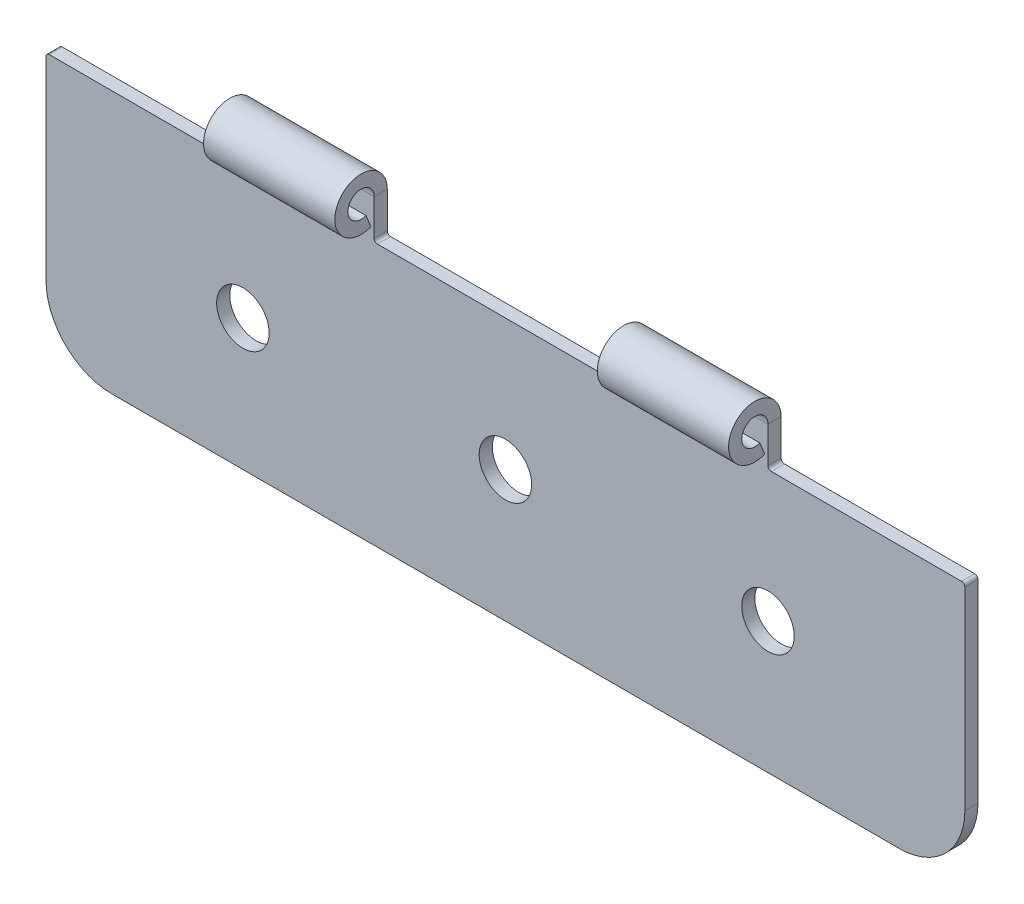
ISO-10303-21;
HEADER;
FILE_DESCRIPTION(('STEP AP214'),'2;1');
FILE_NAME('part.step','',(''),(''),'','','');
FILE_SCHEMA(('AUTOMOTIVE_DESIGN { 1 0 10303 214 1 1 1 1 }'));
ENDSEC;
DATA;
#1=APPLICATION_CONTEXT('core data for automotive mechanical design processes');
#2=APPLICATION_PROTOCOL_DEFINITION('international standard','automotive_design',2000,#1);
#3=PRODUCT_CONTEXT('',#1,'mechanical');
#4=PRODUCT('Part','Part','',(#3));
#5=PRODUCT_RELATED_PRODUCT_CATEGORY('part','',(#4));
#6=PRODUCT_DEFINITION_FORMATION('','',#4);
#7=PRODUCT_DEFINITION_CONTEXT('part definition',#1,'design');
#8=PRODUCT_DEFINITION('design','',#6,#7);
#9=PRODUCT_DEFINITION_SHAPE('','',#8);
#10=(LENGTH_UNIT() NAMED_UNIT(*) SI_UNIT(.MILLI.,.METRE.));
#11=(NAMED_UNIT(*) PLANE_ANGLE_UNIT() SI_UNIT($,.RADIAN.));
#12=(NAMED_UNIT(*) SI_UNIT($,.STERADIAN.) SOLID_ANGLE_UNIT());
#13=UNCERTAINTY_MEASURE_WITH_UNIT(LENGTH_MEASURE(1.E-05),#10,'distance_accuracy_value','');
#14=(GEOMETRIC_REPRESENTATION_CONTEXT(3) GLOBAL_UNCERTAINTY_ASSIGNED_CONTEXT((#13)) GLOBAL_UNIT_ASSIGNED_CONTEXT((#10,
#11,#12)) REPRESENTATION_CONTEXT('',''));
#15=CARTESIAN_POINT('',(0.,0.,0.));
#16=DIRECTION('',(0.,0.,1.));
#17=DIRECTION('',(1.,0.,0.));
#18=AXIS2_PLACEMENT_3D('',#15,#16,#17);
#19=CARTESIAN_POINT('',(45.,20.,-1.));
#20=DIRECTION('',(-1.,0.,0.));
#21=DIRECTION('',(0.,0.,1.));
#22=AXIS2_PLACEMENT_3D('',#19,#20,#21);
#23=PLANE('',#22);
#24=DIRECTION('',(0.,-1.,0.));
#25=VECTOR('',#24,1.);
#26=CARTESIAN_POINT('',(45.,20.,-1.));
#27=LINE('',#26,#25);
#28=CARTESIAN_POINT('',(45.,23.,-1.));
#29=VERTEX_POINT('',#28);
#30=CARTESIAN_POINT('',(45.,20.25,-1.));
#31=VERTEX_POINT('',#30);
#32=EDGE_CURVE('E213',#29,#31,#27,.T.);
#33=ORIENTED_EDGE('',*,*,#32,.T.);
#34=DIRECTION('',(0.,0.,1.));
#35=VECTOR('',#34,1.);
#36=CARTESIAN_POINT('',(45.,20.25,0.));
#37=LINE('',#36,#35);
#38=CARTESIAN_POINT('',(45.,20.25,0.));
#39=VERTEX_POINT('',#38);
#40=EDGE_CURVE('E422',#31,#39,#37,.T.);
#41=ORIENTED_EDGE('',*,*,#40,.T.);
#42=DIRECTION('',(0.,-1.,0.));
#43=VECTOR('',#42,1.);
#44=CARTESIAN_POINT('',(45.,20.,0.));
#45=LINE('',#44,#43);
#46=CARTESIAN_POINT('',(45.,23.,0.));
#47=VERTEX_POINT('',#46);
#48=EDGE_CURVE('E365',#47,#39,#45,.T.);
#49=ORIENTED_EDGE('',*,*,#48,.F.);
#50=DIRECTION('',(0.,0.,-1.));
#51=VECTOR('',#50,1.);
#52=CARTESIAN_POINT('',(45.,23.,0.));
#53=LINE('',#52,#51);
#54=EDGE_CURVE('E226',#47,#29,#53,.T.);
#55=ORIENTED_EDGE('',*,*,#54,.T.);
#56=EDGE_LOOP('',(#33,#41,#49,#55));
#57=FACE_BOUND('',#56,.T.);
#58=ADVANCED_FACE('F41',(#57),#23,.T.);
#59=CARTESIAN_POINT('',(15.,20.,-1.));
#60=DIRECTION('',(-1.,0.,0.));
#61=DIRECTION('',(0.,0.,1.));
#62=AXIS2_PLACEMENT_3D('',#59,#60,#61);
#63=PLANE('',#62);
#64=DIRECTION('',(0.,-1.,0.));
#65=VECTOR('',#64,1.);
#66=CARTESIAN_POINT('',(15.,20.,-1.));
#67=LINE('',#66,#65);
#68=CARTESIAN_POINT('',(15.,23.,-1.));
#69=VERTEX_POINT('',#68);
#70=CARTESIAN_POINT('',(15.,20.25,-1.));
#71=VERTEX_POINT('',#70);
#72=EDGE_CURVE('E339',#69,#71,#67,.T.);
#73=ORIENTED_EDGE('',*,*,#72,.T.);
#74=DIRECTION('',(0.,0.,1.));
#75=VECTOR('',#74,1.);
#76=CARTESIAN_POINT('',(15.,20.25,0.));
#77=LINE('',#76,#75);
#78=CARTESIAN_POINT('',(15.,20.25,0.));
#79=VERTEX_POINT('',#78);
#80=EDGE_CURVE('E436',#71,#79,#77,.T.);
#81=ORIENTED_EDGE('',*,*,#80,.T.);
#82=DIRECTION('',(0.,-1.,0.));
#83=VECTOR('',#82,1.);
#84=CARTESIAN_POINT('',(15.,20.,0.));
#85=LINE('',#84,#83);
#86=CARTESIAN_POINT('',(15.,23.,0.));
#87=VERTEX_POINT('',#86);
#88=EDGE_CURVE('E376',#87,#79,#85,.T.);
#89=ORIENTED_EDGE('',*,*,#88,.F.);
#90=DIRECTION('',(0.,0.,-1.));
#91=VECTOR('',#90,1.);
#92=CARTESIAN_POINT('',(15.,23.,0.));
#93=LINE('',#92,#91);
#94=EDGE_CURVE('E284',#87,#69,#93,.T.);
#95=ORIENTED_EDGE('',*,*,#94,.T.);
#96=EDGE_LOOP('',(#73,#81,#89,#95));
#97=FACE_BOUND('',#96,.T.);
#98=ADVANCED_FACE('F558',(#97),#63,.T.);
#99=CARTESIAN_POINT('',(70.,0.,-1.));
#100=DIRECTION('',(0.,-1.,0.));
#101=DIRECTION('',(1.,0.,0.));
#102=AXIS2_PLACEMENT_3D('',#99,#100,#101);
#103=PLANE('',#102);
#104=DIRECTION('',(1.,0.,0.));
#105=VECTOR('',#104,1.);
#106=CARTESIAN_POINT('',(70.,0.,0.));
#107=LINE('',#106,#105);
#108=CARTESIAN_POINT('',(5.,0.,0.));
#109=VERTEX_POINT('',#108);
#110=CARTESIAN_POINT('',(65.,0.,0.));
#111=VERTEX_POINT('',#110);
#112=EDGE_CURVE('E316',#109,#111,#107,.T.);
#113=ORIENTED_EDGE('',*,*,#112,.F.);
#114=DIRECTION('',(0.,0.,1.));
#115=VECTOR('',#114,1.);
#116=CARTESIAN_POINT('',(5.,0.,-1.));
#117=LINE('',#116,#115);
#118=CARTESIAN_POINT('',(5.,0.,-1.));
#119=VERTEX_POINT('',#118);
#120=EDGE_CURVE('E478',#109,#119,#117,.F.);
#121=ORIENTED_EDGE('',*,*,#120,.T.);
#122=DIRECTION('',(1.,0.,0.));
#123=VECTOR('',#122,1.);
#124=CARTESIAN_POINT('',(70.,0.,-1.));
#125=LINE('',#124,#123);
#126=CARTESIAN_POINT('',(65.,0.,-1.));
#127=VERTEX_POINT('',#126);
#128=EDGE_CURVE('E320',#119,#127,#125,.T.);
#129=ORIENTED_EDGE('',*,*,#128,.T.);
#130=DIRECTION('',(0.,0.,1.));
#131=VECTOR('',#130,1.);
#132=CARTESIAN_POINT('',(65.,0.,-1.));
#133=LINE('',#132,#131);
#134=EDGE_CURVE('E474',#127,#111,#133,.T.);
#135=ORIENTED_EDGE('',*,*,#134,.T.);
#136=EDGE_LOOP('',(#113,#121,#129,#135));
#137=FACE_BOUND('',#136,.T.);
#138=ADVANCED_FACE('F498',(#137),#103,.T.);
#139=CARTESIAN_POINT('',(0.,0.,-1.));
#140=DIRECTION('',(-1.,0.,0.));
#141=DIRECTION('',(0.,0.,1.));
#142=AXIS2_PLACEMENT_3D('',#139,#140,#141);
#143=PLANE('',#142);
#144=DIRECTION('',(0.,-1.,0.));
#145=VECTOR('',#144,1.);
#146=CARTESIAN_POINT('',(0.,0.,-1.));
#147=LINE('',#146,#145);
#148=CARTESIAN_POINT('',(0.,19.75,-1.));
#149=VERTEX_POINT('',#148);
#150=CARTESIAN_POINT('',(0.,5.,-1.));
#151=VERTEX_POINT('',#150);
#152=EDGE_CURVE('E347',#149,#151,#147,.T.);
#153=ORIENTED_EDGE('',*,*,#152,.T.);
#154=DIRECTION('',(0.,0.,1.));
#155=VECTOR('',#154,1.);
#156=CARTESIAN_POINT('',(0.,5.,-1.));
#157=LINE('',#156,#155);
#158=CARTESIAN_POINT('',(0.,5.,0.));
#159=VERTEX_POINT('',#158);
#160=EDGE_CURVE('E464',#151,#159,#157,.T.);
#161=ORIENTED_EDGE('',*,*,#160,.T.);
#162=DIRECTION('',(0.,-1.,0.));
#163=VECTOR('',#162,1.);
#164=CARTESIAN_POINT('',(0.,0.,0.));
#165=LINE('',#164,#163);
#166=CARTESIAN_POINT('',(0.,19.75,0.));
#167=VERTEX_POINT('',#166);
#168=EDGE_CURVE('E324',#167,#159,#165,.T.);
#169=ORIENTED_EDGE('',*,*,#168,.F.);
#170=DIRECTION('',(0.,0.,1.));
#171=VECTOR('',#170,1.);
#172=CARTESIAN_POINT('',(0.,19.75,-1.));
#173=LINE('',#172,#171);
#174=EDGE_CURVE('E399',#167,#149,#173,.F.);
#175=ORIENTED_EDGE('',*,*,#174,.T.);
#176=EDGE_LOOP('',(#153,#161,#169,#175));
#177=FACE_BOUND('',#176,.T.);
#178=ADVANCED_FACE('F490',(#177),#143,.T.);
#179=CARTESIAN_POINT('',(0.,20.,-1.));
#180=DIRECTION('',(0.,1.,0.));
#181=DIRECTION('',(0.,0.,1.));
#182=AXIS2_PLACEMENT_3D('',#179,#180,#181);
#183=PLANE('',#182);
#184=DIRECTION('',(-1.,0.,0.));
#185=VECTOR('',#184,1.);
#186=CARTESIAN_POINT('',(0.,20.,-1.));
#187=LINE('',#186,#185);
#188=CARTESIAN_POINT('',(14.75,20.,-1.));
#189=VERTEX_POINT('',#188);
#190=CARTESIAN_POINT('',(0.25,20.,-1.));
#191=VERTEX_POINT('',#190);
#192=EDGE_CURVE('E343',#189,#191,#187,.T.);
#193=ORIENTED_EDGE('',*,*,#192,.T.);
#194=DIRECTION('',(0.,0.,1.));
#195=VECTOR('',#194,1.);
#196=CARTESIAN_POINT('',(0.25,20.,-1.));
#197=LINE('',#196,#195);
#198=CARTESIAN_POINT('',(0.25,20.,0.));
#199=VERTEX_POINT('',#198);
#200=EDGE_CURVE('E389',#191,#199,#197,.T.);
#201=ORIENTED_EDGE('',*,*,#200,.T.);
#202=DIRECTION('',(-1.,0.,0.));
#203=VECTOR('',#202,1.);
#204=CARTESIAN_POINT('',(0.,20.,0.));
#205=LINE('',#204,#203);
#206=CARTESIAN_POINT('',(14.75,20.,0.));
#207=VERTEX_POINT('',#206);
#208=EDGE_CURVE('E380',#207,#199,#205,.T.);
#209=ORIENTED_EDGE('',*,*,#208,.F.);
#210=DIRECTION('',(0.,0.,1.));
#211=VECTOR('',#210,1.);
#212=CARTESIAN_POINT('',(14.75,20.,-1.));
#213=LINE('',#212,#211);
#214=EDGE_CURVE('E351',#207,#189,#213,.F.);
#215=ORIENTED_EDGE('',*,*,#214,.T.);
#216=EDGE_LOOP('',(#193,#201,#209,#215));
#217=FACE_BOUND('',#216,.T.);
#218=ADVANCED_FACE('F566',(#217),#183,.T.);
#219=CARTESIAN_POINT('',(25.,25.,-1.));
#220=DIRECTION('',(1.,0.,0.));
#221=DIRECTION('',(0.,0.,-1.));
#222=AXIS2_PLACEMENT_3D('',#219,#220,#221);
#223=PLANE('',#222);
#224=DIRECTION('',(0.,1.,0.));
#225=VECTOR('',#224,1.);
#226=CARTESIAN_POINT('',(25.,25.,0.));
#227=LINE('',#226,#225);
#228=CARTESIAN_POINT('',(25.,20.25,0.));
#229=VERTEX_POINT('',#228);
#230=CARTESIAN_POINT('',(25.,23.,0.));
#231=VERTEX_POINT('',#230);
#232=EDGE_CURVE('E373',#229,#231,#227,.T.);
#233=ORIENTED_EDGE('',*,*,#232,.F.);
#234=DIRECTION('',(0.,0.,1.));
#235=VECTOR('',#234,1.);
#236=CARTESIAN_POINT('',(25.,20.25,-1.));
#237=LINE('',#236,#235);
#238=CARTESIAN_POINT('',(25.,20.25,-1.));
#239=VERTEX_POINT('',#238);
#240=EDGE_CURVE('E433',#229,#239,#237,.F.);
#241=ORIENTED_EDGE('',*,*,#240,.T.);
#242=DIRECTION('',(0.,1.,0.));
#243=VECTOR('',#242,1.);
#244=CARTESIAN_POINT('',(25.,25.,-1.));
#245=LINE('',#244,#243);
#246=CARTESIAN_POINT('',(25.,23.,-1.));
#247=VERTEX_POINT('',#246);
#248=EDGE_CURVE('E336',#239,#247,#245,.T.);
#249=ORIENTED_EDGE('',*,*,#248,.T.);
#250=DIRECTION('',(0.,0.,-1.));
#251=VECTOR('',#250,1.);
#252=CARTESIAN_POINT('',(25.,23.,0.));
#253=LINE('',#252,#251);
#254=EDGE_CURVE('E306',#231,#247,#253,.T.);
#255=ORIENTED_EDGE('',*,*,#254,.F.);
#256=EDGE_LOOP('',(#233,#241,#249,#255));
#257=FACE_BOUND('',#256,.T.);
#258=ADVANCED_FACE('F544',(#257),#223,.T.);
#259=CARTESIAN_POINT('',(25.,20.,-1.));
#260=DIRECTION('',(0.,1.,0.));
#261=DIRECTION('',(0.,0.,1.));
#262=AXIS2_PLACEMENT_3D('',#259,#260,#261);
#263=PLANE('',#262);
#264=DIRECTION('',(-1.,0.,0.));
#265=VECTOR('',#264,1.);
#266=CARTESIAN_POINT('',(25.,20.,0.));
#267=LINE('',#266,#265);
#268=CARTESIAN_POINT('',(44.75,20.,0.));
#269=VERTEX_POINT('',#268);
#270=CARTESIAN_POINT('',(25.25,20.,0.));
#271=VERTEX_POINT('',#270);
#272=EDGE_CURVE('E369',#269,#271,#267,.T.);
#273=ORIENTED_EDGE('',*,*,#272,.F.);
#274=DIRECTION('',(0.,0.,1.));
#275=VECTOR('',#274,1.);
#276=CARTESIAN_POINT('',(44.75,20.,-1.));
#277=LINE('',#276,#275);
#278=CARTESIAN_POINT('',(44.75,20.,-1.));
#279=VERTEX_POINT('',#278);
#280=EDGE_CURVE('E430',#269,#279,#277,.F.);
#281=ORIENTED_EDGE('',*,*,#280,.T.);
#282=DIRECTION('',(-1.,0.,0.));
#283=VECTOR('',#282,1.);
#284=CARTESIAN_POINT('',(25.,20.,-1.));
#285=LINE('',#284,#283);
#286=CARTESIAN_POINT('',(25.25,20.,-1.));
#287=VERTEX_POINT('',#286);
#288=EDGE_CURVE('E332',#279,#287,#285,.T.);
#289=ORIENTED_EDGE('',*,*,#288,.T.);
#290=DIRECTION('',(0.,0.,1.));
#291=VECTOR('',#290,1.);
#292=CARTESIAN_POINT('',(25.25,20.,0.));
#293=LINE('',#292,#291);
#294=EDGE_CURVE('E426',#287,#271,#293,.T.);
#295=ORIENTED_EDGE('',*,*,#294,.T.);
#296=EDGE_LOOP('',(#273,#281,#289,#295));
#297=FACE_BOUND('',#296,.T.);
#298=ADVANCED_FACE('F530',(#297),#263,.T.);
#299=CARTESIAN_POINT('',(55.,25.,-1.));
#300=DIRECTION('',(1.,0.,0.));
#301=DIRECTION('',(0.,0.,-1.));
#302=AXIS2_PLACEMENT_3D('',#299,#300,#301);
#303=PLANE('',#302);
#304=DIRECTION('',(0.,1.,0.));
#305=VECTOR('',#304,1.);
#306=CARTESIAN_POINT('',(55.,25.,0.));
#307=LINE('',#306,#305);
#308=CARTESIAN_POINT('',(55.,20.25,0.));
#309=VERTEX_POINT('',#308);
#310=CARTESIAN_POINT('',(55.,23.,0.));
#311=VERTEX_POINT('',#310);
#312=EDGE_CURVE('E362',#309,#311,#307,.T.);
#313=ORIENTED_EDGE('',*,*,#312,.F.);
#314=DIRECTION('',(0.,0.,1.));
#315=VECTOR('',#314,1.);
#316=CARTESIAN_POINT('',(55.,20.25,-1.));
#317=LINE('',#316,#315);
#318=CARTESIAN_POINT('',(55.,20.25,-1.));
#319=VERTEX_POINT('',#318);
#320=EDGE_CURVE('E209',#309,#319,#317,.F.);
#321=ORIENTED_EDGE('',*,*,#320,.T.);
#322=DIRECTION('',(0.,1.,0.));
#323=VECTOR('',#322,1.);
#324=CARTESIAN_POINT('',(55.,25.,-1.));
#325=LINE('',#324,#323);
#326=CARTESIAN_POINT('',(55.,23.,-1.));
#327=VERTEX_POINT('',#326);
#328=EDGE_CURVE('E203',#319,#327,#325,.T.);
#329=ORIENTED_EDGE('',*,*,#328,.T.);
#330=DIRECTION('',(0.,0.,-1.));
#331=VECTOR('',#330,1.);
#332=CARTESIAN_POINT('',(55.,23.,0.));
#333=LINE('',#332,#331);
#334=EDGE_CURVE('E207',#311,#327,#333,.T.);
#335=ORIENTED_EDGE('',*,*,#334,.F.);
#336=EDGE_LOOP('',(#313,#321,#329,#335));
#337=FACE_BOUND('',#336,.T.);
#338=ADVANCED_FACE('F206',(#337),#303,.T.);
#339=CARTESIAN_POINT('',(55.,20.,-1.));
#340=DIRECTION('',(0.,1.,0.));
#341=DIRECTION('',(0.,0.,1.));
#342=AXIS2_PLACEMENT_3D('',#339,#340,#341);
#343=PLANE('',#342);
#344=DIRECTION('',(-1.,0.,0.));
#345=VECTOR('',#344,1.);
#346=CARTESIAN_POINT('',(55.,20.,0.));
#347=LINE('',#346,#345);
#348=CARTESIAN_POINT('',(69.75,20.,0.));
#349=VERTEX_POINT('',#348);
#350=CARTESIAN_POINT('',(55.25,20.,0.));
#351=VERTEX_POINT('',#350);
#352=EDGE_CURVE('E358',#349,#351,#347,.T.);
#353=ORIENTED_EDGE('',*,*,#352,.F.);
#354=DIRECTION('',(0.,0.,1.));
#355=VECTOR('',#354,1.);
#356=CARTESIAN_POINT('',(69.75,20.,-1.));
#357=LINE('',#356,#355);
#358=CARTESIAN_POINT('',(69.75,20.,-1.));
#359=VERTEX_POINT('',#358);
#360=EDGE_CURVE('E417',#349,#359,#357,.F.);
#361=ORIENTED_EDGE('',*,*,#360,.T.);
#362=DIRECTION('',(-1.,0.,0.));
#363=VECTOR('',#362,1.);
#364=CARTESIAN_POINT('',(55.,20.,-1.));
#365=LINE('',#364,#363);
#366=CARTESIAN_POINT('',(55.25,20.,-1.));
#367=VERTEX_POINT('',#366);
#368=EDGE_CURVE('E214',#359,#367,#365,.T.);
#369=ORIENTED_EDGE('',*,*,#368,.T.);
#370=DIRECTION('',(0.,0.,1.));
#371=VECTOR('',#370,1.);
#372=CARTESIAN_POINT('',(55.25,20.,0.));
#373=LINE('',#372,#371);
#374=EDGE_CURVE('E413',#367,#351,#373,.T.);
#375=ORIENTED_EDGE('',*,*,#374,.T.);
#376=EDGE_LOOP('',(#353,#361,#369,#375));
#377=FACE_BOUND('',#376,.T.);
#378=ADVANCED_FACE('F510',(#377),#343,.T.);
#379=CARTESIAN_POINT('',(70.,20.,-1.));
#380=DIRECTION('',(1.,0.,0.));
#381=DIRECTION('',(0.,0.,-1.));
#382=AXIS2_PLACEMENT_3D('',#379,#380,#381);
#383=PLANE('',#382);
#384=DIRECTION('',(0.,1.,0.));
#385=VECTOR('',#384,1.);
#386=CARTESIAN_POINT('',(70.,20.,0.));
#387=LINE('',#386,#385);
#388=CARTESIAN_POINT('',(70.,5.,0.));
#389=VERTEX_POINT('',#388);
#390=CARTESIAN_POINT('',(70.,19.75,0.));
#391=VERTEX_POINT('',#390);
#392=EDGE_CURVE('E355',#389,#391,#387,.T.);
#393=ORIENTED_EDGE('',*,*,#392,.F.);
#394=DIRECTION('',(0.,0.,1.));
#395=VECTOR('',#394,1.);
#396=CARTESIAN_POINT('',(70.,5.,-1.));
#397=LINE('',#396,#395);
#398=CARTESIAN_POINT('',(70.,5.,-1.));
#399=VERTEX_POINT('',#398);
#400=EDGE_CURVE('E11',#389,#399,#397,.F.);
#401=ORIENTED_EDGE('',*,*,#400,.T.);
#402=DIRECTION('',(0.,1.,0.));
#403=VECTOR('',#402,1.);
#404=CARTESIAN_POINT('',(70.,20.,-1.));
#405=LINE('',#404,#403);
#406=CARTESIAN_POINT('',(70.,19.75,-1.));
#407=VERTEX_POINT('',#406);
#408=EDGE_CURVE('E323',#399,#407,#405,.T.);
#409=ORIENTED_EDGE('',*,*,#408,.T.);
#410=DIRECTION('',(0.,0.,1.));
#411=VECTOR('',#410,1.);
#412=CARTESIAN_POINT('',(70.,19.75,-1.));
#413=LINE('',#412,#411);
#414=EDGE_CURVE('E409',#407,#391,#413,.T.);
#415=ORIENTED_EDGE('',*,*,#414,.T.);
#416=EDGE_LOOP('',(#393,#401,#409,#415));
#417=FACE_BOUND('',#416,.T.);
#418=ADVANCED_FACE('F502',(#417),#383,.T.);
#419=CARTESIAN_POINT('',(0.,0.,-1.));
#420=DIRECTION('',(0.,0.,-1.));
#421=DIRECTION('',(-1.,0.,0.));
#422=AXIS2_PLACEMENT_3D('',#419,#420,#421);
#423=PLANE('',#422);
#424=CARTESIAN_POINT('',(55.,10.,-1.));
#425=DIRECTION('',(0.,0.,1.));
#426=DIRECTION('',(1.,0.,0.));
#427=AXIS2_PLACEMENT_3D('',#424,#425,#426);
#428=CIRCLE('',#427,2.);
#429=CARTESIAN_POINT('',(57.,10.,-1.));
#430=VERTEX_POINT('',#429);
#431=EDGE_CURVE('E917',#430,#430,#428,.T.);
#432=ORIENTED_EDGE('',*,*,#431,.T.);
#433=EDGE_LOOP('',(#432));
#434=FACE_BOUND('',#433,.T.);
#435=CARTESIAN_POINT('',(35.,10.,-1.));
#436=DIRECTION('',(0.,0.,1.));
#437=DIRECTION('',(1.,0.,0.));
#438=AXIS2_PLACEMENT_3D('',#435,#436,#437);
#439=CIRCLE('',#438,2.);
#440=CARTESIAN_POINT('',(37.,10.,-1.));
#441=VERTEX_POINT('',#440);
#442=EDGE_CURVE('E911',#441,#441,#439,.T.);
#443=ORIENTED_EDGE('',*,*,#442,.T.);
#444=EDGE_LOOP('',(#443));
#445=FACE_BOUND('',#444,.T.);
#446=CARTESIAN_POINT('',(15.,10.,-1.));
#447=DIRECTION('',(0.,0.,1.));
#448=DIRECTION('',(1.,0.,0.));
#449=AXIS2_PLACEMENT_3D('',#446,#447,#448);
#450=CIRCLE('',#449,2.);
#451=CARTESIAN_POINT('',(17.,10.,-1.));
#452=VERTEX_POINT('',#451);
#453=EDGE_CURVE('E264',#452,#452,#450,.T.);
#454=ORIENTED_EDGE('',*,*,#453,.T.);
#455=EDGE_LOOP('',(#454));
#456=FACE_BOUND('',#455,.T.);
#457=ORIENTED_EDGE('',*,*,#128,.F.);
#458=CARTESIAN_POINT('',(5.,5.,-1.));
#459=DIRECTION('',(0.,0.,-1.));
#460=DIRECTION('',(-1.,0.,0.));
#461=AXIS2_PLACEMENT_3D('',#458,#459,#460);
#462=CIRCLE('',#461,5.);
#463=EDGE_CURVE('E50',#119,#151,#462,.T.);
#464=ORIENTED_EDGE('',*,*,#463,.T.);
#465=ORIENTED_EDGE('',*,*,#152,.F.);
#466=CARTESIAN_POINT('',(0.25,19.75,-1.));
#467=DIRECTION('',(0.,0.,-1.));
#468=DIRECTION('',(-1.,0.,0.));
#469=AXIS2_PLACEMENT_3D('',#466,#467,#468);
#470=CIRCLE('',#469,0.25);
#471=EDGE_CURVE('E406',#149,#191,#470,.T.);
#472=ORIENTED_EDGE('',*,*,#471,.T.);
#473=ORIENTED_EDGE('',*,*,#192,.F.);
#474=CARTESIAN_POINT('',(14.75,20.25,-1.));
#475=DIRECTION('',(0.,0.,-1.));
#476=DIRECTION('',(-1.,0.,0.));
#477=AXIS2_PLACEMENT_3D('',#474,#475,#476);
#478=CIRCLE('',#477,0.25);
#479=EDGE_CURVE('E461',#189,#71,#478,.F.);
#480=ORIENTED_EDGE('',*,*,#479,.T.);
#481=ORIENTED_EDGE('',*,*,#72,.F.);
#482=DIRECTION('',(-1.,0.,0.));
#483=VECTOR('',#482,1.);
#484=CARTESIAN_POINT('',(15.,23.,-1.));
#485=LINE('',#484,#483);
#486=EDGE_CURVE('E275',#69,#247,#485,.F.);
#487=ORIENTED_EDGE('',*,*,#486,.T.);
#488=ORIENTED_EDGE('',*,*,#248,.F.);
#489=CARTESIAN_POINT('',(25.25,20.25,-1.));
#490=DIRECTION('',(0.,0.,-1.));
#491=DIRECTION('',(-1.,0.,0.));
#492=AXIS2_PLACEMENT_3D('',#489,#490,#491);
#493=CIRCLE('',#492,0.25);
#494=EDGE_CURVE('E455',#239,#287,#493,.F.);
#495=ORIENTED_EDGE('',*,*,#494,.T.);
#496=ORIENTED_EDGE('',*,*,#288,.F.);
#497=CARTESIAN_POINT('',(44.75,20.25,-1.));
#498=DIRECTION('',(0.,0.,-1.));
#499=DIRECTION('',(-1.,0.,0.));
#500=AXIS2_PLACEMENT_3D('',#497,#498,#499);
#501=CIRCLE('',#500,0.25);
#502=EDGE_CURVE('E449',#279,#31,#501,.F.);
#503=ORIENTED_EDGE('',*,*,#502,.T.);
#504=ORIENTED_EDGE('',*,*,#32,.F.);
#505=DIRECTION('',(-1.,0.,0.));
#506=VECTOR('',#505,1.);
#507=CARTESIAN_POINT('',(45.,23.,-1.));
#508=LINE('',#507,#506);
#509=EDGE_CURVE('E232',#29,#327,#508,.F.);
#510=ORIENTED_EDGE('',*,*,#509,.T.);
#511=ORIENTED_EDGE('',*,*,#328,.F.);
#512=CARTESIAN_POINT('',(55.25,20.25,-1.));
#513=DIRECTION('',(0.,0.,-1.));
#514=DIRECTION('',(-1.,0.,0.));
#515=AXIS2_PLACEMENT_3D('',#512,#513,#514);
#516=CIRCLE('',#515,0.25);
#517=EDGE_CURVE('E443',#319,#367,#516,.F.);
#518=ORIENTED_EDGE('',*,*,#517,.T.);
#519=ORIENTED_EDGE('',*,*,#368,.F.);
#520=CARTESIAN_POINT('',(69.75,19.75,-1.));
#521=DIRECTION('',(0.,0.,-1.));
#522=DIRECTION('',(-1.,0.,0.));
#523=AXIS2_PLACEMENT_3D('',#520,#521,#522);
#524=CIRCLE('',#523,0.25);
#525=EDGE_CURVE('E402',#359,#407,#524,.T.);
#526=ORIENTED_EDGE('',*,*,#525,.T.);
#527=ORIENTED_EDGE('',*,*,#408,.F.);
#528=CARTESIAN_POINT('',(65.,5.,-1.));
#529=DIRECTION('',(0.,0.,-1.));
#530=DIRECTION('',(-1.,0.,0.));
#531=AXIS2_PLACEMENT_3D('',#528,#529,#530);
#532=CIRCLE('',#531,5.);
#533=EDGE_CURVE('E62',#399,#127,#532,.T.);
#534=ORIENTED_EDGE('',*,*,#533,.T.);
#535=EDGE_LOOP('',(#457,#464,#465,#472,#473,#480,#481,#487,#488,#495,#496,#503,#504,#510,#511,
#518,#519,#526,#527,#534));
#536=FACE_BOUND('',#535,.T.);
#537=ADVANCED_FACE('F239',(#434,#445,#456,#536),#423,.T.);
#538=CARTESIAN_POINT('',(0.,0.,0.));
#539=DIRECTION('',(0.,0.,-1.));
#540=DIRECTION('',(-1.,0.,0.));
#541=AXIS2_PLACEMENT_3D('',#538,#539,#540);
#542=PLANE('',#541);
#543=CARTESIAN_POINT('',(55.,10.,0.));
#544=DIRECTION('',(0.,0.,1.));
#545=DIRECTION('',(1.,0.,0.));
#546=AXIS2_PLACEMENT_3D('',#543,#544,#545);
#547=CIRCLE('',#546,2.);
#548=CARTESIAN_POINT('',(57.,10.,0.));
#549=VERTEX_POINT('',#548);
#550=EDGE_CURVE('E923',#549,#549,#547,.T.);
#551=ORIENTED_EDGE('',*,*,#550,.F.);
#552=EDGE_LOOP('',(#551));
#553=FACE_BOUND('',#552,.T.);
#554=CARTESIAN_POINT('',(35.,10.,0.));
#555=DIRECTION('',(0.,0.,1.));
#556=DIRECTION('',(1.,0.,0.));
#557=AXIS2_PLACEMENT_3D('',#554,#555,#556);
#558=CIRCLE('',#557,2.);
#559=CARTESIAN_POINT('',(37.,10.,0.));
#560=VERTEX_POINT('',#559);
#561=EDGE_CURVE('E914',#560,#560,#558,.T.);
#562=ORIENTED_EDGE('',*,*,#561,.F.);
#563=EDGE_LOOP('',(#562));
#564=FACE_BOUND('',#563,.T.);
#565=CARTESIAN_POINT('',(15.,10.,0.));
#566=DIRECTION('',(0.,0.,1.));
#567=DIRECTION('',(1.,0.,0.));
#568=AXIS2_PLACEMENT_3D('',#565,#566,#567);
#569=CIRCLE('',#568,2.);
#570=CARTESIAN_POINT('',(17.,10.,0.));
#571=VERTEX_POINT('',#570);
#572=EDGE_CURVE('E247',#571,#571,#569,.T.);
#573=ORIENTED_EDGE('',*,*,#572,.F.);
#574=EDGE_LOOP('',(#573));
#575=FACE_BOUND('',#574,.T.);
#576=ORIENTED_EDGE('',*,*,#168,.T.);
#577=CARTESIAN_POINT('',(5.,5.,0.));
#578=DIRECTION('',(0.,0.,-1.));
#579=DIRECTION('',(-1.,0.,0.));
#580=AXIS2_PLACEMENT_3D('',#577,#578,#579);
#581=CIRCLE('',#580,5.);
#582=EDGE_CURVE('E471',#159,#109,#581,.F.);
#583=ORIENTED_EDGE('',*,*,#582,.T.);
#584=ORIENTED_EDGE('',*,*,#112,.T.);
#585=CARTESIAN_POINT('',(65.,5.,0.));
#586=DIRECTION('',(0.,0.,-1.));
#587=DIRECTION('',(-1.,0.,0.));
#588=AXIS2_PLACEMENT_3D('',#585,#586,#587);
#589=CIRCLE('',#588,5.);
#590=EDGE_CURVE('E468',#111,#389,#589,.F.);
#591=ORIENTED_EDGE('',*,*,#590,.T.);
#592=ORIENTED_EDGE('',*,*,#392,.T.);
#593=CARTESIAN_POINT('',(69.75,19.75,0.));
#594=DIRECTION('',(0.,0.,-1.));
#595=DIRECTION('',(-1.,0.,0.));
#596=AXIS2_PLACEMENT_3D('',#593,#594,#595);
#597=CIRCLE('',#596,0.25);
#598=EDGE_CURVE('E393',#391,#349,#597,.F.);
#599=ORIENTED_EDGE('',*,*,#598,.T.);
#600=ORIENTED_EDGE('',*,*,#352,.T.);
#601=CARTESIAN_POINT('',(55.25,20.25,0.));
#602=DIRECTION('',(0.,0.,-1.));
#603=DIRECTION('',(-1.,0.,0.));
#604=AXIS2_PLACEMENT_3D('',#601,#602,#603);
#605=CIRCLE('',#604,0.25);
#606=EDGE_CURVE('E440',#351,#309,#605,.T.);
#607=ORIENTED_EDGE('',*,*,#606,.T.);
#608=ORIENTED_EDGE('',*,*,#312,.T.);
#609=DIRECTION('',(-1.,0.,0.));
#610=VECTOR('',#609,1.);
#611=CARTESIAN_POINT('',(45.,23.,0.));
#612=LINE('',#611,#610);
#613=EDGE_CURVE('E254',#47,#311,#612,.F.);
#614=ORIENTED_EDGE('',*,*,#613,.F.);
#615=ORIENTED_EDGE('',*,*,#48,.T.);
#616=CARTESIAN_POINT('',(44.75,20.25,0.));
#617=DIRECTION('',(0.,0.,-1.));
#618=DIRECTION('',(-1.,0.,0.));
#619=AXIS2_PLACEMENT_3D('',#616,#617,#618);
#620=CIRCLE('',#619,0.25);
#621=EDGE_CURVE('E446',#39,#269,#620,.T.);
#622=ORIENTED_EDGE('',*,*,#621,.T.);
#623=ORIENTED_EDGE('',*,*,#272,.T.);
#624=CARTESIAN_POINT('',(25.25,20.25,0.));
#625=DIRECTION('',(0.,0.,-1.));
#626=DIRECTION('',(-1.,0.,0.));
#627=AXIS2_PLACEMENT_3D('',#624,#625,#626);
#628=CIRCLE('',#627,0.25);
#629=EDGE_CURVE('E452',#271,#229,#628,.T.);
#630=ORIENTED_EDGE('',*,*,#629,.T.);
#631=ORIENTED_EDGE('',*,*,#232,.T.);
#632=DIRECTION('',(-1.,0.,0.));
#633=VECTOR('',#632,1.);
#634=CARTESIAN_POINT('',(15.,23.,0.));
#635=LINE('',#634,#633);
#636=EDGE_CURVE('E296',#87,#231,#635,.F.);
#637=ORIENTED_EDGE('',*,*,#636,.F.);
#638=ORIENTED_EDGE('',*,*,#88,.T.);
#639=CARTESIAN_POINT('',(14.75,20.25,0.));
#640=DIRECTION('',(0.,0.,-1.));
#641=DIRECTION('',(-1.,0.,0.));
#642=AXIS2_PLACEMENT_3D('',#639,#640,#641);
#643=CIRCLE('',#642,0.25);
#644=EDGE_CURVE('E458',#79,#207,#643,.T.);
#645=ORIENTED_EDGE('',*,*,#644,.T.);
#646=ORIENTED_EDGE('',*,*,#208,.T.);
#647=CARTESIAN_POINT('',(0.25,19.75,0.));
#648=DIRECTION('',(0.,0.,-1.));
#649=DIRECTION('',(-1.,0.,0.));
#650=AXIS2_PLACEMENT_3D('',#647,#648,#649);
#651=CIRCLE('',#650,0.25);
#652=EDGE_CURVE('E396',#199,#167,#651,.F.);
#653=ORIENTED_EDGE('',*,*,#652,.T.);
#654=EDGE_LOOP('',(#576,#583,#584,#591,#592,#599,#600,#607,#608,#614,#615,#622,#623,#630,#631,
#637,#638,#645,#646,#653));
#655=FACE_BOUND('',#654,.T.);
#656=ADVANCED_FACE('F496',(#553,#564,#575,#655),#542,.F.);
#657=CARTESIAN_POINT('',(20.,22.0728161454332,0.62539340658408));
#658=DIRECTION('',(0.,-0.374606593415919,0.927183854566785));
#659=DIRECTION('',(-1.,0.,0.));
#660=AXIS2_PLACEMENT_3D('',#657,#658,#659);
#661=PLANE('',#660);
#662=DIRECTION('',(0.,-0.927183854566785,-0.374606593415919));
#663=VECTOR('',#662,1.);
#664=CARTESIAN_POINT('',(15.,22.0728161454332,0.62539340658408));
#665=LINE('',#664,#663);
#666=CARTESIAN_POINT('',(15.,22.0728161454332,0.62539340658408));
#667=VERTEX_POINT('',#666);
#668=CARTESIAN_POINT('',(15.,21.1456322908664,0.250786813168161));
#669=VERTEX_POINT('',#668);
#670=EDGE_CURVE('E313',#667,#669,#665,.T.);
#671=ORIENTED_EDGE('',*,*,#670,.F.);
#672=DIRECTION('',(-1.,0.,0.));
#673=VECTOR('',#672,1.);
#674=CARTESIAN_POINT('',(15.,22.0728161454332,0.62539340658408));
#675=LINE('',#674,#673);
#676=CARTESIAN_POINT('',(25.,22.0728161454332,0.62539340658408));
#677=VERTEX_POINT('',#676);
#678=EDGE_CURVE('E271',#677,#667,#675,.T.);
#679=ORIENTED_EDGE('',*,*,#678,.F.);
#680=DIRECTION('',(0.,-0.927183854566785,-0.374606593415919));
#681=VECTOR('',#680,1.);
#682=CARTESIAN_POINT('',(25.,22.0728161454332,0.62539340658408));
#683=LINE('',#682,#681);
#684=CARTESIAN_POINT('',(25.,21.1456322908664,0.250786813168161));
#685=VERTEX_POINT('',#684);
#686=EDGE_CURVE('E310',#677,#685,#683,.T.);
#687=ORIENTED_EDGE('',*,*,#686,.T.);
#688=DIRECTION('',(-1.,0.,0.));
#689=VECTOR('',#688,1.);
#690=CARTESIAN_POINT('',(15.,21.1456322908664,0.250786813168161));
#691=LINE('',#690,#689);
#692=EDGE_CURVE('E285',#685,#669,#691,.T.);
#693=ORIENTED_EDGE('',*,*,#692,.T.);
#694=EDGE_LOOP('',(#671,#679,#687,#693));
#695=FACE_BOUND('',#694,.T.);
#696=ADVANCED_FACE('F637',(#695),#661,.F.);
#697=CARTESIAN_POINT('',(25.,23.,1.));
#698=DIRECTION('',(1.,0.,0.));
#699=DIRECTION('',(0.,0.,-1.));
#700=AXIS2_PLACEMENT_3D('',#697,#698,#699);
#701=PLANE('',#700);
#702=ORIENTED_EDGE('',*,*,#686,.F.);
#703=CARTESIAN_POINT('',(25.,23.,1.));
#704=DIRECTION('',(-1.,0.,0.));
#705=DIRECTION('',(0.,0.,1.));
#706=AXIS2_PLACEMENT_3D('',#703,#704,#705);
#707=CIRCLE('',#706,1.);
#708=EDGE_CURVE('E289',#231,#677,#707,.F.);
#709=ORIENTED_EDGE('',*,*,#708,.F.);
#710=ORIENTED_EDGE('',*,*,#254,.T.);
#711=CARTESIAN_POINT('',(25.,23.,1.));
#712=DIRECTION('',(-1.,0.,0.));
#713=DIRECTION('',(0.,0.,1.));
#714=AXIS2_PLACEMENT_3D('',#711,#712,#713);
#715=CIRCLE('',#714,2.);
#716=EDGE_CURVE('E279',#247,#685,#715,.F.);
#717=ORIENTED_EDGE('',*,*,#716,.T.);
#718=EDGE_LOOP('',(#702,#709,#710,#717));
#719=FACE_BOUND('',#718,.T.);
#720=ADVANCED_FACE('F548',(#719),#701,.T.);
#721=CARTESIAN_POINT('',(15.,23.,1.));
#722=DIRECTION('',(1.,0.,0.));
#723=DIRECTION('',(0.,0.,-1.));
#724=AXIS2_PLACEMENT_3D('',#721,#722,#723);
#725=PLANE('',#724);
#726=CARTESIAN_POINT('',(15.,23.,1.));
#727=DIRECTION('',(-1.,0.,0.));
#728=DIRECTION('',(0.,0.,1.));
#729=AXIS2_PLACEMENT_3D('',#726,#727,#728);
#730=CIRCLE('',#729,1.);
#731=EDGE_CURVE('E300',#667,#87,#730,.T.);
#732=ORIENTED_EDGE('',*,*,#731,.F.);
#733=ORIENTED_EDGE('',*,*,#670,.T.);
#734=CARTESIAN_POINT('',(15.,23.,1.));
#735=DIRECTION('',(-1.,0.,0.));
#736=DIRECTION('',(0.,0.,1.));
#737=AXIS2_PLACEMENT_3D('',#734,#735,#736);
#738=CIRCLE('',#737,2.);
#739=EDGE_CURVE('E280',#669,#69,#738,.T.);
#740=ORIENTED_EDGE('',*,*,#739,.T.);
#741=ORIENTED_EDGE('',*,*,#94,.F.);
#742=EDGE_LOOP('',(#732,#733,#740,#741));
#743=FACE_BOUND('',#742,.T.);
#744=ADVANCED_FACE('F652',(#743),#725,.F.);
#745=CARTESIAN_POINT('',(15.,23.,1.));
#746=DIRECTION('',(-1.,0.,0.));
#747=DIRECTION('',(0.,-0.927183854566784,-0.374606593415919));
#748=AXIS2_PLACEMENT_3D('',#745,#746,#747);
#749=CYLINDRICAL_SURFACE('',#748,2.);
#750=ORIENTED_EDGE('',*,*,#486,.F.);
#751=ORIENTED_EDGE('',*,*,#739,.F.);
#752=ORIENTED_EDGE('',*,*,#692,.F.);
#753=ORIENTED_EDGE('',*,*,#716,.F.);
#754=EDGE_LOOP('',(#750,#751,#752,#753));
#755=FACE_BOUND('',#754,.T.);
#756=ADVANCED_FACE('F551',(#755),#749,.T.);
#757=CARTESIAN_POINT('',(15.,23.,1.));
#758=DIRECTION('',(-1.,0.,0.));
#759=DIRECTION('',(0.,-0.927183854566784,-0.374606593415919));
#760=AXIS2_PLACEMENT_3D('',#757,#758,#759);
#761=CYLINDRICAL_SURFACE('',#760,1.);
#762=ORIENTED_EDGE('',*,*,#636,.T.);
#763=ORIENTED_EDGE('',*,*,#708,.T.);
#764=ORIENTED_EDGE('',*,*,#678,.T.);
#765=ORIENTED_EDGE('',*,*,#731,.T.);
#766=EDGE_LOOP('',(#762,#763,#764,#765));
#767=FACE_BOUND('',#766,.T.);
#768=ADVANCED_FACE('F666',(#767),#761,.F.);
#769=CARTESIAN_POINT('',(50.,22.0728161454332,0.62539340658408));
#770=DIRECTION('',(0.,-0.374606593415919,0.927183854566785));
#771=DIRECTION('',(-1.,0.,0.));
#772=AXIS2_PLACEMENT_3D('',#769,#770,#771);
#773=PLANE('',#772);
#774=DIRECTION('',(0.,-0.927183854566785,-0.374606593415919));
#775=VECTOR('',#774,1.);
#776=CARTESIAN_POINT('',(45.,22.0728161454332,0.62539340658408));
#777=LINE('',#776,#775);
#778=CARTESIAN_POINT('',(45.,22.0728161454332,0.62539340658408));
#779=VERTEX_POINT('',#778);
#780=CARTESIAN_POINT('',(45.,21.1456322908664,0.250786813168161));
#781=VERTEX_POINT('',#780);
#782=EDGE_CURVE('E268',#779,#781,#777,.T.);
#783=ORIENTED_EDGE('',*,*,#782,.F.);
#784=DIRECTION('',(-1.,0.,0.));
#785=VECTOR('',#784,1.);
#786=CARTESIAN_POINT('',(45.,22.0728161454332,0.62539340658408));
#787=LINE('',#786,#785);
#788=CARTESIAN_POINT('',(55.,22.0728161454332,0.62539340658408));
#789=VERTEX_POINT('',#788);
#790=EDGE_CURVE('E261',#789,#779,#787,.T.);
#791=ORIENTED_EDGE('',*,*,#790,.F.);
#792=DIRECTION('',(0.,-0.927183854566785,-0.374606593415919));
#793=VECTOR('',#792,1.);
#794=CARTESIAN_POINT('',(55.,22.0728161454332,0.62539340658408));
#795=LINE('',#794,#793);
#796=CARTESIAN_POINT('',(55.,21.1456322908664,0.250786813168161));
#797=VERTEX_POINT('',#796);
#798=EDGE_CURVE('E225',#789,#797,#795,.T.);
#799=ORIENTED_EDGE('',*,*,#798,.T.);
#800=DIRECTION('',(-1.,0.,0.));
#801=VECTOR('',#800,1.);
#802=CARTESIAN_POINT('',(45.,21.1456322908664,0.250786813168161));
#803=LINE('',#802,#801);
#804=EDGE_CURVE('E235',#797,#781,#803,.T.);
#805=ORIENTED_EDGE('',*,*,#804,.T.);
#806=EDGE_LOOP('',(#783,#791,#799,#805));
#807=FACE_BOUND('',#806,.T.);
#808=ADVANCED_FACE('F673',(#807),#773,.F.);
#809=CARTESIAN_POINT('',(55.,23.,1.));
#810=DIRECTION('',(1.,0.,0.));
#811=DIRECTION('',(0.,0.,-1.));
#812=AXIS2_PLACEMENT_3D('',#809,#810,#811);
#813=PLANE('',#812);
#814=ORIENTED_EDGE('',*,*,#798,.F.);
#815=CARTESIAN_POINT('',(55.,23.,1.));
#816=DIRECTION('',(-1.,0.,0.));
#817=DIRECTION('',(0.,0.,1.));
#818=AXIS2_PLACEMENT_3D('',#815,#816,#817);
#819=CIRCLE('',#818,1.);
#820=EDGE_CURVE('E223',#311,#789,#819,.F.);
#821=ORIENTED_EDGE('',*,*,#820,.F.);
#822=ORIENTED_EDGE('',*,*,#334,.T.);
#823=CARTESIAN_POINT('',(55.,23.,1.));
#824=DIRECTION('',(-1.,0.,0.));
#825=DIRECTION('',(0.,0.,1.));
#826=AXIS2_PLACEMENT_3D('',#823,#824,#825);
#827=CIRCLE('',#826,2.);
#828=EDGE_CURVE('E221',#327,#797,#827,.F.);
#829=ORIENTED_EDGE('',*,*,#828,.T.);
#830=EDGE_LOOP('',(#814,#821,#822,#829));
#831=FACE_BOUND('',#830,.T.);
#832=ADVANCED_FACE('F220',(#831),#813,.T.);
#833=CARTESIAN_POINT('',(45.,23.,1.));
#834=DIRECTION('',(1.,0.,0.));
#835=DIRECTION('',(0.,0.,-1.));
#836=AXIS2_PLACEMENT_3D('',#833,#834,#835);
#837=PLANE('',#836);
#838=CARTESIAN_POINT('',(45.,23.,1.));
#839=DIRECTION('',(-1.,0.,0.));
#840=DIRECTION('',(0.,0.,1.));
#841=AXIS2_PLACEMENT_3D('',#838,#839,#840);
#842=CIRCLE('',#841,1.);
#843=EDGE_CURVE('E258',#779,#47,#842,.T.);
#844=ORIENTED_EDGE('',*,*,#843,.F.);
#845=ORIENTED_EDGE('',*,*,#782,.T.);
#846=CARTESIAN_POINT('',(45.,23.,1.));
#847=DIRECTION('',(-1.,0.,0.));
#848=DIRECTION('',(0.,0.,1.));
#849=AXIS2_PLACEMENT_3D('',#846,#847,#848);
#850=CIRCLE('',#849,2.);
#851=EDGE_CURVE('E242',#781,#29,#850,.T.);
#852=ORIENTED_EDGE('',*,*,#851,.T.);
#853=ORIENTED_EDGE('',*,*,#54,.F.);
#854=EDGE_LOOP('',(#844,#845,#852,#853));
#855=FACE_BOUND('',#854,.T.);
#856=ADVANCED_FACE('F523',(#855),#837,.F.);
#857=CARTESIAN_POINT('',(45.,23.,1.));
#858=DIRECTION('',(-1.,0.,0.));
#859=DIRECTION('',(0.,-0.927183854566784,-0.374606593415919));
#860=AXIS2_PLACEMENT_3D('',#857,#858,#859);
#861=CYLINDRICAL_SURFACE('',#860,2.);
#862=ORIENTED_EDGE('',*,*,#509,.F.);
#863=ORIENTED_EDGE('',*,*,#851,.F.);
#864=ORIENTED_EDGE('',*,*,#804,.F.);
#865=ORIENTED_EDGE('',*,*,#828,.F.);
#866=EDGE_LOOP('',(#862,#863,#864,#865));
#867=FACE_BOUND('',#866,.T.);
#868=ADVANCED_FACE('F230',(#867),#861,.T.);
#869=CARTESIAN_POINT('',(45.,23.,1.));
#870=DIRECTION('',(-1.,0.,0.));
#871=DIRECTION('',(0.,-0.927183854566784,-0.374606593415919));
#872=AXIS2_PLACEMENT_3D('',#869,#870,#871);
#873=CYLINDRICAL_SURFACE('',#872,1.);
#874=ORIENTED_EDGE('',*,*,#613,.T.);
#875=ORIENTED_EDGE('',*,*,#820,.T.);
#876=ORIENTED_EDGE('',*,*,#790,.T.);
#877=ORIENTED_EDGE('',*,*,#843,.T.);
#878=EDGE_LOOP('',(#874,#875,#876,#877));
#879=FACE_BOUND('',#878,.T.);
#880=ADVANCED_FACE('F518',(#879),#873,.F.);
#881=CARTESIAN_POINT('',(15.,10.,-1.));
#882=DIRECTION('',(0.,0.,1.));
#883=DIRECTION('',(1.,0.,0.));
#884=AXIS2_PLACEMENT_3D('',#881,#882,#883);
#885=CYLINDRICAL_SURFACE('',#884,2.);
#886=ORIENTED_EDGE('',*,*,#453,.F.);
#887=EDGE_LOOP('',(#886));
#888=FACE_BOUND('',#887,.T.);
#889=ORIENTED_EDGE('',*,*,#572,.T.);
#890=EDGE_LOOP('',(#889));
#891=FACE_BOUND('',#890,.T.);
#892=ADVANCED_FACE('F706',(#888,#891),#885,.F.);
#893=CARTESIAN_POINT('',(35.,10.,-1.));
#894=DIRECTION('',(0.,0.,1.));
#895=DIRECTION('',(1.,0.,0.));
#896=AXIS2_PLACEMENT_3D('',#893,#894,#895);
#897=CYLINDRICAL_SURFACE('',#896,2.);
#898=ORIENTED_EDGE('',*,*,#442,.F.);
#899=EDGE_LOOP('',(#898));
#900=FACE_BOUND('',#899,.T.);
#901=ORIENTED_EDGE('',*,*,#561,.T.);
#902=EDGE_LOOP('',(#901));
#903=FACE_BOUND('',#902,.T.);
#904=ADVANCED_FACE('F578',(#900,#903),#897,.F.);
#905=CARTESIAN_POINT('',(55.,10.,-1.));
#906=DIRECTION('',(0.,0.,1.));
#907=DIRECTION('',(1.,0.,0.));
#908=AXIS2_PLACEMENT_3D('',#905,#906,#907);
#909=CYLINDRICAL_SURFACE('',#908,2.);
#910=ORIENTED_EDGE('',*,*,#431,.F.);
#911=EDGE_LOOP('',(#910));
#912=FACE_BOUND('',#911,.T.);
#913=ORIENTED_EDGE('',*,*,#550,.T.);
#914=EDGE_LOOP('',(#913));
#915=FACE_BOUND('',#914,.T.);
#916=ADVANCED_FACE('F571',(#912,#915),#909,.F.);
#917=CARTESIAN_POINT('',(0.25,19.75,-1.));
#918=DIRECTION('',(0.,0.,1.));
#919=DIRECTION('',(1.,0.,0.));
#920=AXIS2_PLACEMENT_3D('',#917,#918,#919);
#921=CYLINDRICAL_SURFACE('',#920,0.25);
#922=ORIENTED_EDGE('',*,*,#471,.F.);
#923=ORIENTED_EDGE('',*,*,#174,.F.);
#924=ORIENTED_EDGE('',*,*,#652,.F.);
#925=ORIENTED_EDGE('',*,*,#200,.F.);
#926=EDGE_LOOP('',(#922,#923,#924,#925));
#927=FACE_BOUND('',#926,.T.);
#928=ADVANCED_FACE('F569',(#927),#921,.T.);
#929=CARTESIAN_POINT('',(69.75,19.75,-1.));
#930=DIRECTION('',(0.,0.,1.));
#931=DIRECTION('',(1.,0.,0.));
#932=AXIS2_PLACEMENT_3D('',#929,#930,#931);
#933=CYLINDRICAL_SURFACE('',#932,0.25);
#934=ORIENTED_EDGE('',*,*,#525,.F.);
#935=ORIENTED_EDGE('',*,*,#360,.F.);
#936=ORIENTED_EDGE('',*,*,#598,.F.);
#937=ORIENTED_EDGE('',*,*,#414,.F.);
#938=EDGE_LOOP('',(#934,#935,#936,#937));
#939=FACE_BOUND('',#938,.T.);
#940=ADVANCED_FACE('F506',(#939),#933,.T.);
#941=CARTESIAN_POINT('',(55.25,20.25,-1.));
#942=DIRECTION('',(0.,0.,-1.));
#943=DIRECTION('',(-1.,0.,0.));
#944=AXIS2_PLACEMENT_3D('',#941,#942,#943);
#945=CYLINDRICAL_SURFACE('',#944,0.25);
#946=ORIENTED_EDGE('',*,*,#517,.F.);
#947=ORIENTED_EDGE('',*,*,#320,.F.);
#948=ORIENTED_EDGE('',*,*,#606,.F.);
#949=ORIENTED_EDGE('',*,*,#374,.F.);
#950=EDGE_LOOP('',(#946,#947,#948,#949));
#951=FACE_BOUND('',#950,.T.);
#952=ADVANCED_FACE('F514',(#951),#945,.F.);
#953=CARTESIAN_POINT('',(44.75,20.25,-1.));
#954=DIRECTION('',(0.,0.,-1.));
#955=DIRECTION('',(-1.,0.,0.));
#956=AXIS2_PLACEMENT_3D('',#953,#954,#955);
#957=CYLINDRICAL_SURFACE('',#956,0.25);
#958=ORIENTED_EDGE('',*,*,#502,.F.);
#959=ORIENTED_EDGE('',*,*,#280,.F.);
#960=ORIENTED_EDGE('',*,*,#621,.F.);
#961=ORIENTED_EDGE('',*,*,#40,.F.);
#962=EDGE_LOOP('',(#958,#959,#960,#961));
#963=FACE_BOUND('',#962,.T.);
#964=ADVANCED_FACE('F534',(#963),#957,.F.);
#965=CARTESIAN_POINT('',(25.25,20.25,-1.));
#966=DIRECTION('',(0.,0.,-1.));
#967=DIRECTION('',(-1.,0.,0.));
#968=AXIS2_PLACEMENT_3D('',#965,#966,#967);
#969=CYLINDRICAL_SURFACE('',#968,0.25);
#970=ORIENTED_EDGE('',*,*,#494,.F.);
#971=ORIENTED_EDGE('',*,*,#240,.F.);
#972=ORIENTED_EDGE('',*,*,#629,.F.);
#973=ORIENTED_EDGE('',*,*,#294,.F.);
#974=EDGE_LOOP('',(#970,#971,#972,#973));
#975=FACE_BOUND('',#974,.T.);
#976=ADVANCED_FACE('F538',(#975),#969,.F.);
#977=CARTESIAN_POINT('',(14.75,20.25,-1.));
#978=DIRECTION('',(0.,0.,-1.));
#979=DIRECTION('',(-1.,0.,0.));
#980=AXIS2_PLACEMENT_3D('',#977,#978,#979);
#981=CYLINDRICAL_SURFACE('',#980,0.25);
#982=ORIENTED_EDGE('',*,*,#479,.F.);
#983=ORIENTED_EDGE('',*,*,#214,.F.);
#984=ORIENTED_EDGE('',*,*,#644,.F.);
#985=ORIENTED_EDGE('',*,*,#80,.F.);
#986=EDGE_LOOP('',(#982,#983,#984,#985));
#987=FACE_BOUND('',#986,.T.);
#988=ADVANCED_FACE('F562',(#987),#981,.F.);
#989=CARTESIAN_POINT('',(5.,5.,-1.));
#990=DIRECTION('',(0.,0.,1.));
#991=DIRECTION('',(1.,0.,0.));
#992=AXIS2_PLACEMENT_3D('',#989,#990,#991);
#993=CYLINDRICAL_SURFACE('',#992,5.);
#994=ORIENTED_EDGE('',*,*,#463,.F.);
#995=ORIENTED_EDGE('',*,*,#120,.F.);
#996=ORIENTED_EDGE('',*,*,#582,.F.);
#997=ORIENTED_EDGE('',*,*,#160,.F.);
#998=EDGE_LOOP('',(#994,#995,#996,#997));
#999=FACE_BOUND('',#998,.T.);
#1000=ADVANCED_FACE('F493',(#999),#993,.T.);
#1001=CARTESIAN_POINT('',(65.,5.,-1.));
#1002=DIRECTION('',(0.,0.,1.));
#1003=DIRECTION('',(1.,0.,0.));
#1004=AXIS2_PLACEMENT_3D('',#1001,#1002,#1003);
#1005=CYLINDRICAL_SURFACE('',#1004,5.);
#1006=ORIENTED_EDGE('',*,*,#533,.F.);
#1007=ORIENTED_EDGE('',*,*,#400,.F.);
#1008=ORIENTED_EDGE('',*,*,#590,.F.);
#1009=ORIENTED_EDGE('',*,*,#134,.F.);
#1010=EDGE_LOOP('',(#1006,#1007,#1008,#1009));
#1011=FACE_BOUND('',#1010,.T.);
#1012=ADVANCED_FACE('F43',(#1011),#1005,.T.);
#1013=CLOSED_SHELL('',(#58,#98,#138,#178,#218,#258,#298,#338,#378,#418,#537,#656,#696,#720,#744,
#756,#768,#808,#832,#856,#868,#880,#892,#904,#916,#928,#940,#952,#964,#976,#988,#1000,#1012));
#1014=MANIFOLD_SOLID_BREP('B2',#1013);
#1015=ADVANCED_BREP_SHAPE_REPRESENTATION('',(#18,#1014),#14);
#1016=SHAPE_DEFINITION_REPRESENTATION(#9,#1015);
ENDSEC;
END-ISO-10303-21;
